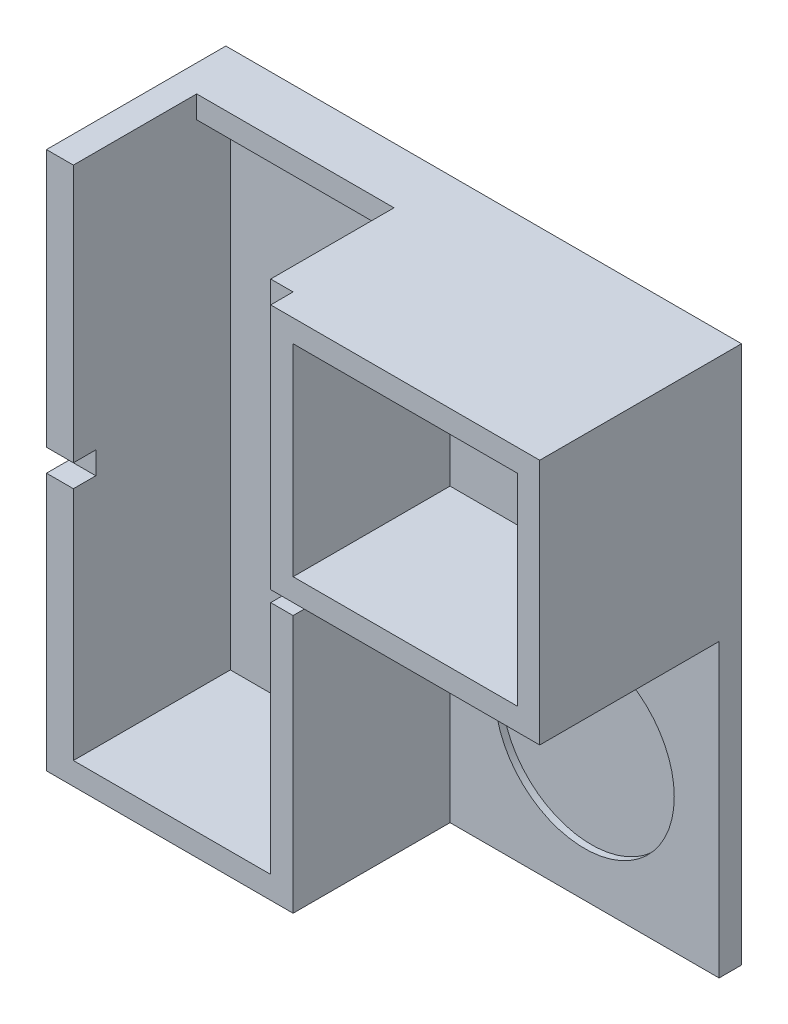
ISO-10303-21;
HEADER;
FILE_DESCRIPTION(('STEP AP214'),'2;1');
FILE_NAME('part.step','',(''),(''),'','','');
FILE_SCHEMA(('AUTOMOTIVE_DESIGN { 1 0 10303 214 1 1 1 1 }'));
ENDSEC;
DATA;
#1=APPLICATION_CONTEXT('core data for automotive mechanical design processes');
#2=APPLICATION_PROTOCOL_DEFINITION('international standard','automotive_design',2000,#1);
#3=PRODUCT_CONTEXT('',#1,'mechanical');
#4=PRODUCT('Part','Part','',(#3));
#5=PRODUCT_RELATED_PRODUCT_CATEGORY('part','',(#4));
#6=PRODUCT_DEFINITION_FORMATION('','',#4);
#7=PRODUCT_DEFINITION_CONTEXT('part definition',#1,'design');
#8=PRODUCT_DEFINITION('design','',#6,#7);
#9=PRODUCT_DEFINITION_SHAPE('','',#8);
#10=(LENGTH_UNIT() NAMED_UNIT(*) SI_UNIT(.MILLI.,.METRE.));
#11=(NAMED_UNIT(*) PLANE_ANGLE_UNIT() SI_UNIT($,.RADIAN.));
#12=(NAMED_UNIT(*) SI_UNIT($,.STERADIAN.) SOLID_ANGLE_UNIT());
#13=UNCERTAINTY_MEASURE_WITH_UNIT(LENGTH_MEASURE(1.E-05),#10,'distance_accuracy_value','');
#14=(GEOMETRIC_REPRESENTATION_CONTEXT(3) GLOBAL_UNCERTAINTY_ASSIGNED_CONTEXT((#13)) GLOBAL_UNIT_ASSIGNED_CONTEXT((#10,
#11,#12)) REPRESENTATION_CONTEXT('',''));
#15=CARTESIAN_POINT('',(0.,0.,0.));
#16=DIRECTION('',(0.,0.,1.));
#17=DIRECTION('',(1.,0.,0.));
#18=AXIS2_PLACEMENT_3D('',#15,#16,#17);
#19=CARTESIAN_POINT('',(-99.2177037871918,25.0239424703892,10.));
#20=DIRECTION('',(0.,-1.,0.));
#21=DIRECTION('',(1.,0.,0.));
#22=AXIS2_PLACEMENT_3D('',#19,#20,#21);
#23=PLANE('',#22);
#24=DIRECTION('',(0.,0.,1.));
#25=VECTOR('',#24,1.);
#26=CARTESIAN_POINT('',(-59.2177037871918,25.0239424703892,25.));
#27=LINE('',#26,#25);
#28=CARTESIAN_POINT('',(-59.2177037871918,25.0239424703892,25.));
#29=VERTEX_POINT('',#28);
#30=CARTESIAN_POINT('',(-59.2177037871918,25.0239424703892,80.));
#31=VERTEX_POINT('',#30);
#32=EDGE_CURVE('E349',#29,#31,#27,.T.);
#33=ORIENTED_EDGE('',*,*,#32,.T.);
#34=DIRECTION('',(-1.,0.,0.));
#35=VECTOR('',#34,1.);
#36=CARTESIAN_POINT('',(-49.2177037871919,25.0239424703891,80.));
#37=LINE('',#36,#35);
#38=CARTESIAN_POINT('',(-49.2177037871919,25.0239424703891,80.));
#39=VERTEX_POINT('',#38);
#40=EDGE_CURVE('E289',#39,#31,#37,.T.);
#41=ORIENTED_EDGE('',*,*,#40,.F.);
#42=DIRECTION('',(0.,0.,-1.));
#43=VECTOR('',#42,1.);
#44=CARTESIAN_POINT('',(-49.2177037871919,25.0239424703892,90.));
#45=LINE('',#44,#43);
#46=CARTESIAN_POINT('',(-49.2177037871919,25.0239424703892,90.));
#47=VERTEX_POINT('',#46);
#48=EDGE_CURVE('E355',#47,#39,#45,.T.);
#49=ORIENTED_EDGE('',*,*,#48,.F.);
#50=DIRECTION('',(1.,0.,0.));
#51=VECTOR('',#50,1.);
#52=CARTESIAN_POINT('',(-49.2177037871919,25.0239424703892,90.));
#53=LINE('',#52,#51);
#54=CARTESIAN_POINT('',(70.7822962128082,25.0239424703892,90.));
#55=VERTEX_POINT('',#54);
#56=EDGE_CURVE('E366',#47,#55,#53,.T.);
#57=ORIENTED_EDGE('',*,*,#56,.T.);
#58=DIRECTION('',(0.,0.,-1.));
#59=VECTOR('',#58,1.);
#60=CARTESIAN_POINT('',(70.7822962128082,25.0239424703892,10.));
#61=LINE('',#60,#59);
#62=CARTESIAN_POINT('',(70.7822962128082,25.0239424703892,0.));
#63=VERTEX_POINT('',#62);
#64=EDGE_CURVE('E92',#55,#63,#61,.T.);
#65=ORIENTED_EDGE('',*,*,#64,.T.);
#66=DIRECTION('',(-1.,0.,0.));
#67=VECTOR('',#66,1.);
#68=CARTESIAN_POINT('',(-99.2177037871918,25.0239424703892,0.));
#69=LINE('',#68,#67);
#70=CARTESIAN_POINT('',(-159.217703787192,25.0239424703892,0.));
#71=VERTEX_POINT('',#70);
#72=EDGE_CURVE('E534',#63,#71,#69,.T.);
#73=ORIENTED_EDGE('',*,*,#72,.T.);
#74=DIRECTION('',(0.,0.,1.));
#75=VECTOR('',#74,1.);
#76=CARTESIAN_POINT('',(-159.217703787192,25.0239424703892,10.));
#77=LINE('',#76,#75);
#78=CARTESIAN_POINT('',(-159.217703787192,25.0239424703891,80.));
#79=VERTEX_POINT('',#78);
#80=EDGE_CURVE('E288',#71,#79,#77,.T.);
#81=ORIENTED_EDGE('',*,*,#80,.T.);
#82=CARTESIAN_POINT('',(-147.217703787192,25.0239424703892,80.));
#83=VERTEX_POINT('',#82);
#84=EDGE_CURVE('E280',#83,#79,#37,.T.);
#85=ORIENTED_EDGE('',*,*,#84,.F.);
#86=DIRECTION('',(0.,0.,-1.));
#87=VECTOR('',#86,1.);
#88=CARTESIAN_POINT('',(-147.217703787192,25.0239424703892,75.));
#89=LINE('',#88,#87);
#90=CARTESIAN_POINT('',(-147.217703787192,25.0239424703892,25.));
#91=VERTEX_POINT('',#90);
#92=EDGE_CURVE('E263',#83,#91,#89,.T.);
#93=ORIENTED_EDGE('',*,*,#92,.T.);
#94=DIRECTION('',(1.,0.,0.));
#95=VECTOR('',#94,1.);
#96=CARTESIAN_POINT('',(-259.217703787192,25.0239424703891,25.));
#97=LINE('',#96,#95);
#98=EDGE_CURVE('E347',#91,#29,#97,.T.);
#99=ORIENTED_EDGE('',*,*,#98,.T.);
#100=EDGE_LOOP('',(#33,#41,#49,#57,#65,#73,#81,#85,#93,#99));
#101=FACE_BOUND('',#100,.T.);
#102=ADVANCED_FACE('F82',(#101),#23,.F.);
#103=CARTESIAN_POINT('',(0.,0.,80.));
#104=DIRECTION('',(0.,0.,1.));
#105=DIRECTION('',(1.,0.,0.));
#106=AXIS2_PLACEMENT_3D('',#103,#104,#105);
#107=PLANE('',#106);
#108=ORIENTED_EDGE('',*,*,#40,.T.);
#109=DIRECTION('',(0.,-1.,0.));
#110=VECTOR('',#109,1.);
#111=CARTESIAN_POINT('',(-59.2177037871919,15.0239424703891,80.));
#112=LINE('',#111,#110);
#113=CARTESIAN_POINT('',(-59.2177037871919,-89.9760575296108,80.));
#114=VERTEX_POINT('',#113);
#115=EDGE_CURVE('E295',#31,#114,#112,.T.);
#116=ORIENTED_EDGE('',*,*,#115,.T.);
#117=DIRECTION('',(-1.,0.,0.));
#118=VECTOR('',#117,1.);
#119=CARTESIAN_POINT('',(-59.2177037871919,-89.9760575296108,80.));
#120=LINE('',#119,#118);
#121=CARTESIAN_POINT('',(-49.2177037871918,-89.9760575296108,80.));
#122=VERTEX_POINT('',#121);
#123=EDGE_CURVE('E431',#122,#114,#120,.T.);
#124=ORIENTED_EDGE('',*,*,#123,.F.);
#125=DIRECTION('',(0.,1.,0.));
#126=VECTOR('',#125,1.);
#127=CARTESIAN_POINT('',(-49.2177037871918,-214.976057529611,80.));
#128=LINE('',#127,#126);
#129=CARTESIAN_POINT('',(-49.2177037871919,-84.9760575296108,80.));
#130=VERTEX_POINT('',#129);
#131=EDGE_CURVE('E333',#122,#130,#128,.T.);
#132=ORIENTED_EDGE('',*,*,#131,.T.);
#133=EDGE_CURVE('E310',#130,#39,#128,.T.);
#134=ORIENTED_EDGE('',*,*,#133,.T.);
#135=EDGE_LOOP('',(#108,#116,#124,#132,#134));
#136=FACE_BOUND('',#135,.T.);
#137=ADVANCED_FACE('F507',(#136),#107,.T.);
#138=DIRECTION('',(1.,0.,0.));
#139=VECTOR('',#138,1.);
#140=CARTESIAN_POINT('',(-147.217703787192,-99.9760575296109,80.));
#141=LINE('',#140,#139);
#142=CARTESIAN_POINT('',(-159.217703787192,-99.9760575296109,80.));
#143=VERTEX_POINT('',#142);
#144=CARTESIAN_POINT('',(-147.217703787192,-99.9760575296109,80.));
#145=VERTEX_POINT('',#144);
#146=EDGE_CURVE('E453',#143,#145,#141,.T.);
#147=ORIENTED_EDGE('',*,*,#146,.F.);
#148=DIRECTION('',(0.,-1.,0.));
#149=VECTOR('',#148,1.);
#150=CARTESIAN_POINT('',(-159.217703787192,35.0239424703892,80.));
#151=LINE('',#150,#149);
#152=CARTESIAN_POINT('',(-159.217703787192,-214.976057529611,80.));
#153=VERTEX_POINT('',#152);
#154=EDGE_CURVE('E377',#143,#153,#151,.T.);
#155=ORIENTED_EDGE('',*,*,#154,.T.);
#156=DIRECTION('',(-1.,0.,0.));
#157=VECTOR('',#156,1.);
#158=CARTESIAN_POINT('',(-49.2177037871918,-214.976057529611,80.));
#159=LINE('',#158,#157);
#160=CARTESIAN_POINT('',(-49.2177037871918,-214.976057529611,80.));
#161=VERTEX_POINT('',#160);
#162=EDGE_CURVE('E317',#161,#153,#159,.T.);
#163=ORIENTED_EDGE('',*,*,#162,.F.);
#164=CARTESIAN_POINT('',(-49.2177037871918,-99.9760575296108,80.));
#165=VERTEX_POINT('',#164);
#166=EDGE_CURVE('E330',#161,#165,#128,.T.);
#167=ORIENTED_EDGE('',*,*,#166,.T.);
#168=DIRECTION('',(1.,0.,0.));
#169=VECTOR('',#168,1.);
#170=CARTESIAN_POINT('',(-59.2177037871919,-99.9760575296108,80.));
#171=LINE('',#170,#169);
#172=CARTESIAN_POINT('',(-59.2177037871919,-99.9760575296108,80.));
#173=VERTEX_POINT('',#172);
#174=EDGE_CURVE('E434',#173,#165,#171,.T.);
#175=ORIENTED_EDGE('',*,*,#174,.F.);
#176=CARTESIAN_POINT('',(-59.2177037871918,-204.976057529611,80.));
#177=VERTEX_POINT('',#176);
#178=EDGE_CURVE('E86',#173,#177,#112,.T.);
#179=ORIENTED_EDGE('',*,*,#178,.T.);
#180=DIRECTION('',(-1.,0.,0.));
#181=VECTOR('',#180,1.);
#182=CARTESIAN_POINT('',(-49.2177037871918,-204.976057529611,80.));
#183=LINE('',#182,#181);
#184=CARTESIAN_POINT('',(-147.217703787192,-204.976057529611,80.));
#185=VERTEX_POINT('',#184);
#186=EDGE_CURVE('E327',#177,#185,#183,.T.);
#187=ORIENTED_EDGE('',*,*,#186,.T.);
#188=DIRECTION('',(0.,1.,0.));
#189=VECTOR('',#188,1.);
#190=CARTESIAN_POINT('',(-147.217703787192,-204.976057529611,80.));
#191=LINE('',#190,#189);
#192=EDGE_CURVE('E283',#185,#145,#191,.T.);
#193=ORIENTED_EDGE('',*,*,#192,.T.);
#194=EDGE_LOOP('',(#147,#155,#163,#167,#175,#179,#187,#193));
#195=FACE_BOUND('',#194,.T.);
#196=ADVANCED_FACE('F475',(#195),#107,.T.);
#197=CARTESIAN_POINT('',(-49.2177037871919,15.0239424703891,80.));
#198=DIRECTION('',(0.,-1.,0.));
#199=DIRECTION('',(1.,0.,0.));
#200=AXIS2_PLACEMENT_3D('',#197,#198,#199);
#201=PLANE('',#200);
#202=DIRECTION('',(-1.,0.,0.));
#203=VECTOR('',#202,1.);
#204=CARTESIAN_POINT('',(-49.2177037871919,15.0239424703891,25.));
#205=LINE('',#204,#203);
#206=CARTESIAN_POINT('',(-59.2177037871918,15.0239424703891,25.));
#207=VERTEX_POINT('',#206);
#208=CARTESIAN_POINT('',(-147.217703787192,15.0239424703891,25.));
#209=VERTEX_POINT('',#208);
#210=EDGE_CURVE('E338',#207,#209,#205,.T.);
#211=ORIENTED_EDGE('',*,*,#210,.T.);
#212=DIRECTION('',(0.,0.,1.));
#213=VECTOR('',#212,1.);
#214=CARTESIAN_POINT('',(-147.217703787192,15.0239424703891,80.));
#215=LINE('',#214,#213);
#216=CARTESIAN_POINT('',(-147.217703787192,15.0239424703891,10.));
#217=VERTEX_POINT('',#216);
#218=EDGE_CURVE('E417',#217,#209,#215,.T.);
#219=ORIENTED_EDGE('',*,*,#218,.F.);
#220=DIRECTION('',(-1.,0.,0.));
#221=VECTOR('',#220,1.);
#222=CARTESIAN_POINT('',(-49.2177037871919,15.0239424703891,10.));
#223=LINE('',#222,#221);
#224=CARTESIAN_POINT('',(-59.2177037871919,15.0239424703891,10.));
#225=VERTEX_POINT('',#224);
#226=EDGE_CURVE('E290',#225,#217,#223,.T.);
#227=ORIENTED_EDGE('',*,*,#226,.F.);
#228=DIRECTION('',(0.,0.,-1.));
#229=VECTOR('',#228,1.);
#230=CARTESIAN_POINT('',(-59.2177037871919,15.0239424703891,80.));
#231=LINE('',#230,#229);
#232=EDGE_CURVE('E293',#207,#225,#231,.T.);
#233=ORIENTED_EDGE('',*,*,#232,.F.);
#234=EDGE_LOOP('',(#211,#219,#227,#233));
#235=FACE_BOUND('',#234,.T.);
#236=ADVANCED_FACE('F492',(#235),#201,.T.);
#237=CARTESIAN_POINT('',(0.,0.,10.));
#238=DIRECTION('',(0.,0.,1.));
#239=DIRECTION('',(1.,0.,0.));
#240=AXIS2_PLACEMENT_3D('',#237,#238,#239);
#241=PLANE('',#240);
#242=ORIENTED_EDGE('',*,*,#226,.T.);
#243=DIRECTION('',(0.,1.,0.));
#244=VECTOR('',#243,1.);
#245=CARTESIAN_POINT('',(-147.217703787192,-204.976057529611,10.));
#246=LINE('',#245,#244);
#247=CARTESIAN_POINT('',(-147.217703787192,-204.976057529611,10.));
#248=VERTEX_POINT('',#247);
#249=EDGE_CURVE('E284',#248,#217,#246,.T.);
#250=ORIENTED_EDGE('',*,*,#249,.F.);
#251=DIRECTION('',(-1.,0.,0.));
#252=VECTOR('',#251,1.);
#253=CARTESIAN_POINT('',(-49.2177037871918,-204.976057529611,10.));
#254=LINE('',#253,#252);
#255=CARTESIAN_POINT('',(-59.2177037871918,-204.976057529611,10.));
#256=VERTEX_POINT('',#255);
#257=EDGE_CURVE('E307',#256,#248,#254,.T.);
#258=ORIENTED_EDGE('',*,*,#257,.F.);
#259=DIRECTION('',(0.,-1.,0.));
#260=VECTOR('',#259,1.);
#261=CARTESIAN_POINT('',(-59.2177037871919,15.0239424703891,10.));
#262=LINE('',#261,#260);
#263=EDGE_CURVE('E341',#225,#256,#262,.T.);
#264=ORIENTED_EDGE('',*,*,#263,.F.);
#265=EDGE_LOOP('',(#242,#250,#258,#264));
#266=FACE_BOUND('',#265,.T.);
#267=ADVANCED_FACE('F487',(#266),#241,.T.);
#268=CARTESIAN_POINT('',(-49.2177037871918,-204.976057529611,80.));
#269=DIRECTION('',(0.,-1.,0.));
#270=DIRECTION('',(1.,0.,0.));
#271=AXIS2_PLACEMENT_3D('',#268,#269,#270);
#272=PLANE('',#271);
#273=DIRECTION('',(0.,0.,1.));
#274=VECTOR('',#273,1.);
#275=CARTESIAN_POINT('',(-147.217703787192,-204.976057529611,80.));
#276=LINE('',#275,#274);
#277=EDGE_CURVE('E416',#248,#185,#276,.T.);
#278=ORIENTED_EDGE('',*,*,#277,.T.);
#279=ORIENTED_EDGE('',*,*,#186,.F.);
#280=DIRECTION('',(0.,0.,1.));
#281=VECTOR('',#280,1.);
#282=CARTESIAN_POINT('',(-59.2177037871918,-204.976057529611,80.));
#283=LINE('',#282,#281);
#284=EDGE_CURVE('E316',#256,#177,#283,.T.);
#285=ORIENTED_EDGE('',*,*,#284,.F.);
#286=ORIENTED_EDGE('',*,*,#257,.T.);
#287=EDGE_LOOP('',(#278,#279,#285,#286));
#288=FACE_BOUND('',#287,.T.);
#289=ADVANCED_FACE('F482',(#288),#272,.F.);
#290=CARTESIAN_POINT('',(-259.217703787192,-74.9760575296109,25.));
#291=DIRECTION('',(0.,0.,1.));
#292=DIRECTION('',(1.,0.,0.));
#293=AXIS2_PLACEMENT_3D('',#290,#291,#292);
#294=PLANE('',#293);
#295=ORIENTED_EDGE('',*,*,#98,.F.);
#296=DIRECTION('',(0.,1.,0.));
#297=VECTOR('',#296,1.);
#298=CARTESIAN_POINT('',(-147.217703787192,25.0239424703892,25.));
#299=LINE('',#298,#297);
#300=EDGE_CURVE('E270',#209,#91,#299,.T.);
#301=ORIENTED_EDGE('',*,*,#300,.F.);
#302=ORIENTED_EDGE('',*,*,#210,.F.);
#303=DIRECTION('',(0.,1.,0.));
#304=VECTOR('',#303,1.);
#305=CARTESIAN_POINT('',(-59.2177037871918,-74.9760575296108,25.));
#306=LINE('',#305,#304);
#307=EDGE_CURVE('E344',#207,#29,#306,.T.);
#308=ORIENTED_EDGE('',*,*,#307,.T.);
#309=EDGE_LOOP('',(#295,#301,#302,#308));
#310=FACE_BOUND('',#309,.T.);
#311=ADVANCED_FACE('F494',(#310),#294,.T.);
#312=CARTESIAN_POINT('',(-99.2177037871918,-214.976057529611,10.));
#313=DIRECTION('',(0.,-1.,0.));
#314=DIRECTION('',(1.,0.,0.));
#315=AXIS2_PLACEMENT_3D('',#312,#313,#314);
#316=PLANE('',#315);
#317=DIRECTION('',(0.,0.,1.));
#318=VECTOR('',#317,1.);
#319=CARTESIAN_POINT('',(-159.217703787192,-214.976057529611,80.));
#320=LINE('',#319,#318);
#321=CARTESIAN_POINT('',(-159.217703787192,-214.976057529611,0.));
#322=VERTEX_POINT('',#321);
#323=EDGE_CURVE('E274',#322,#153,#320,.T.);
#324=ORIENTED_EDGE('',*,*,#323,.F.);
#325=DIRECTION('',(-1.,0.,0.));
#326=VECTOR('',#325,1.);
#327=CARTESIAN_POINT('',(-99.2177037871918,-214.976057529611,0.));
#328=LINE('',#327,#326);
#329=CARTESIAN_POINT('',(70.7822962128082,-214.976057529611,0.));
#330=VERTEX_POINT('',#329);
#331=EDGE_CURVE('E536',#330,#322,#328,.T.);
#332=ORIENTED_EDGE('',*,*,#331,.F.);
#333=DIRECTION('',(0.,0.,-1.));
#334=VECTOR('',#333,1.);
#335=CARTESIAN_POINT('',(70.7822962128082,-214.976057529611,10.));
#336=LINE('',#335,#334);
#337=CARTESIAN_POINT('',(70.7822962128082,-214.976057529611,10.));
#338=VERTEX_POINT('',#337);
#339=EDGE_CURVE('E12',#338,#330,#336,.T.);
#340=ORIENTED_EDGE('',*,*,#339,.F.);
#341=DIRECTION('',(1.,0.,0.));
#342=VECTOR('',#341,1.);
#343=CARTESIAN_POINT('',(-99.2177037871918,-214.976057529611,10.));
#344=LINE('',#343,#342);
#345=CARTESIAN_POINT('',(-49.2177037871919,-214.976057529611,10.));
#346=VERTEX_POINT('',#345);
#347=EDGE_CURVE('E320',#346,#338,#344,.T.);
#348=ORIENTED_EDGE('',*,*,#347,.F.);
#349=DIRECTION('',(0.,0.,-1.));
#350=VECTOR('',#349,1.);
#351=CARTESIAN_POINT('',(-49.2177037871918,-214.976057529611,80.));
#352=LINE('',#351,#350);
#353=EDGE_CURVE('E313',#161,#346,#352,.T.);
#354=ORIENTED_EDGE('',*,*,#353,.F.);
#355=ORIENTED_EDGE('',*,*,#162,.T.);
#356=EDGE_LOOP('',(#324,#332,#340,#348,#354,#355));
#357=FACE_BOUND('',#356,.T.);
#358=ADVANCED_FACE('F531',(#357),#316,.T.);
#359=CARTESIAN_POINT('',(70.7822962128082,0.,10.));
#360=DIRECTION('',(1.,0.,0.));
#361=DIRECTION('',(0.,1.,0.));
#362=AXIS2_PLACEMENT_3D('',#359,#360,#361);
#363=PLANE('',#362);
#364=DIRECTION('',(0.,-1.,0.));
#365=VECTOR('',#364,1.);
#366=CARTESIAN_POINT('',(70.7822962128082,0.,0.));
#367=LINE('',#366,#365);
#368=EDGE_CURVE('E542',#63,#330,#367,.T.);
#369=ORIENTED_EDGE('',*,*,#368,.F.);
#370=ORIENTED_EDGE('',*,*,#64,.F.);
#371=DIRECTION('',(0.,1.,0.));
#372=VECTOR('',#371,1.);
#373=CARTESIAN_POINT('',(70.7822962128082,-84.9760575296108,90.));
#374=LINE('',#373,#372);
#375=CARTESIAN_POINT('',(70.7822962128082,-84.9760575296108,90.));
#376=VERTEX_POINT('',#375);
#377=EDGE_CURVE('E363',#376,#55,#374,.T.);
#378=ORIENTED_EDGE('',*,*,#377,.F.);
#379=DIRECTION('',(0.,0.,-1.));
#380=VECTOR('',#379,1.);
#381=CARTESIAN_POINT('',(70.7822962128082,-84.9760575296108,90.));
#382=LINE('',#381,#380);
#383=CARTESIAN_POINT('',(70.7822962128082,-84.9760575296108,10.));
#384=VERTEX_POINT('',#383);
#385=EDGE_CURVE('E351',#376,#384,#382,.T.);
#386=ORIENTED_EDGE('',*,*,#385,.T.);
#387=DIRECTION('',(0.,1.,0.));
#388=VECTOR('',#387,1.);
#389=CARTESIAN_POINT('',(70.7822962128082,0.,10.));
#390=LINE('',#389,#388);
#391=EDGE_CURVE('E532',#338,#384,#390,.T.);
#392=ORIENTED_EDGE('',*,*,#391,.F.);
#393=ORIENTED_EDGE('',*,*,#339,.T.);
#394=EDGE_LOOP('',(#369,#370,#378,#386,#392,#393));
#395=FACE_BOUND('',#394,.T.);
#396=ADVANCED_FACE('F84',(#395),#363,.T.);
#397=DIRECTION('',(-1.,0.,0.));
#398=VECTOR('',#397,1.);
#399=CARTESIAN_POINT('',(70.7822962128082,-84.9760575296108,10.));
#400=LINE('',#399,#398);
#401=CARTESIAN_POINT('',(-49.2177037871919,-84.9760575296108,10.));
#402=VERTEX_POINT('',#401);
#403=EDGE_CURVE('E359',#384,#402,#400,.T.);
#404=ORIENTED_EDGE('',*,*,#403,.T.);
#405=DIRECTION('',(0.,1.,0.));
#406=VECTOR('',#405,1.);
#407=CARTESIAN_POINT('',(-49.2177037871918,-214.976057529611,10.));
#408=LINE('',#407,#406);
#409=EDGE_CURVE('E306',#346,#402,#408,.T.);
#410=ORIENTED_EDGE('',*,*,#409,.F.);
#411=ORIENTED_EDGE('',*,*,#347,.T.);
#412=ORIENTED_EDGE('',*,*,#391,.T.);
#413=EDGE_LOOP('',(#404,#410,#411,#412));
#414=FACE_BOUND('',#413,.T.);
#415=CARTESIAN_POINT('',(10.7822962128082,-154.976057529611,10.));
#416=DIRECTION('',(0.,0.,1.));
#417=DIRECTION('',(1.,0.,0.));
#418=AXIS2_PLACEMENT_3D('',#415,#416,#417);
#419=CIRCLE('',#418,40.);
#420=CARTESIAN_POINT('',(50.7822962128082,-154.976057529611,10.));
#421=VERTEX_POINT('',#420);
#422=EDGE_CURVE('E334',#421,#421,#419,.T.);
#423=ORIENTED_EDGE('',*,*,#422,.F.);
#424=EDGE_LOOP('',(#423));
#425=FACE_BOUND('',#424,.T.);
#426=ADVANCED_FACE('F524',(#414,#425),#241,.T.);
#427=CARTESIAN_POINT('',(0.,0.,0.));
#428=DIRECTION('',(0.,0.,1.));
#429=DIRECTION('',(1.,0.,0.));
#430=AXIS2_PLACEMENT_3D('',#427,#428,#429);
#431=PLANE('',#430);
#432=ORIENTED_EDGE('',*,*,#331,.T.);
#433=DIRECTION('',(0.,-1.,0.));
#434=VECTOR('',#433,1.);
#435=CARTESIAN_POINT('',(-159.217703787192,35.0239424703892,0.));
#436=LINE('',#435,#434);
#437=EDGE_CURVE('E375',#71,#322,#436,.T.);
#438=ORIENTED_EDGE('',*,*,#437,.F.);
#439=ORIENTED_EDGE('',*,*,#72,.F.);
#440=ORIENTED_EDGE('',*,*,#368,.T.);
#441=EDGE_LOOP('',(#432,#438,#439,#440));
#442=FACE_BOUND('',#441,.T.);
#443=ADVANCED_FACE('F548',(#442),#431,.F.);
#444=CARTESIAN_POINT('',(-49.2177037871918,-214.976057529611,80.));
#445=DIRECTION('',(-1.,0.,0.));
#446=DIRECTION('',(0.,-1.,0.));
#447=AXIS2_PLACEMENT_3D('',#444,#445,#446);
#448=PLANE('',#447);
#449=ORIENTED_EDGE('',*,*,#131,.F.);
#450=DIRECTION('',(0.,0.,1.));
#451=VECTOR('',#450,1.);
#452=CARTESIAN_POINT('',(-49.2177037871918,-89.9760575296108,70.));
#453=LINE('',#452,#451);
#454=CARTESIAN_POINT('',(-49.2177037871918,-89.9760575296108,70.));
#455=VERTEX_POINT('',#454);
#456=EDGE_CURVE('E427',#455,#122,#453,.T.);
#457=ORIENTED_EDGE('',*,*,#456,.F.);
#458=DIRECTION('',(0.,1.,0.));
#459=VECTOR('',#458,1.);
#460=CARTESIAN_POINT('',(-49.2177037871918,-99.9760575296108,70.));
#461=LINE('',#460,#459);
#462=CARTESIAN_POINT('',(-49.2177037871918,-99.9760575296108,70.));
#463=VERTEX_POINT('',#462);
#464=EDGE_CURVE('E438',#463,#455,#461,.T.);
#465=ORIENTED_EDGE('',*,*,#464,.F.);
#466=DIRECTION('',(0.,0.,1.));
#467=VECTOR('',#466,1.);
#468=CARTESIAN_POINT('',(-49.2177037871918,-99.9760575296108,70.));
#469=LINE('',#468,#467);
#470=EDGE_CURVE('E424',#463,#165,#469,.T.);
#471=ORIENTED_EDGE('',*,*,#470,.T.);
#472=ORIENTED_EDGE('',*,*,#166,.F.);
#473=ORIENTED_EDGE('',*,*,#353,.T.);
#474=ORIENTED_EDGE('',*,*,#409,.T.);
#475=DIRECTION('',(0.,0.,-1.));
#476=VECTOR('',#475,1.);
#477=CARTESIAN_POINT('',(-49.2177037871919,-84.9760575296108,90.));
#478=LINE('',#477,#476);
#479=EDGE_CURVE('E356',#130,#402,#478,.T.);
#480=ORIENTED_EDGE('',*,*,#479,.F.);
#481=EDGE_LOOP('',(#449,#457,#465,#471,#472,#473,#474,#480));
#482=FACE_BOUND('',#481,.T.);
#483=ADVANCED_FACE('F519',(#482),#448,.F.);
#484=CARTESIAN_POINT('',(-147.217703787192,-89.9760575296108,80.));
#485=VERTEX_POINT('',#484);
#486=EDGE_CURVE('E268',#485,#83,#191,.T.);
#487=ORIENTED_EDGE('',*,*,#486,.T.);
#488=ORIENTED_EDGE('',*,*,#84,.T.);
#489=CARTESIAN_POINT('',(-159.217703787192,-89.9760575296108,80.));
#490=VERTEX_POINT('',#489);
#491=EDGE_CURVE('E374',#79,#490,#151,.T.);
#492=ORIENTED_EDGE('',*,*,#491,.T.);
#493=DIRECTION('',(-1.,0.,0.));
#494=VECTOR('',#493,1.);
#495=CARTESIAN_POINT('',(-147.217703787192,-89.9760575296108,80.));
#496=LINE('',#495,#494);
#497=EDGE_CURVE('E282',#485,#490,#496,.T.);
#498=ORIENTED_EDGE('',*,*,#497,.F.);
#499=EDGE_LOOP('',(#487,#488,#492,#498));
#500=FACE_BOUND('',#499,.T.);
#501=ADVANCED_FACE('F278',(#500),#107,.T.);
#502=CARTESIAN_POINT('',(-59.2177037871919,15.0239424703891,80.));
#503=DIRECTION('',(1.,0.,0.));
#504=DIRECTION('',(0.,1.,0.));
#505=AXIS2_PLACEMENT_3D('',#502,#503,#504);
#506=PLANE('',#505);
#507=ORIENTED_EDGE('',*,*,#115,.F.);
#508=ORIENTED_EDGE('',*,*,#32,.F.);
#509=ORIENTED_EDGE('',*,*,#307,.F.);
#510=ORIENTED_EDGE('',*,*,#232,.T.);
#511=ORIENTED_EDGE('',*,*,#263,.T.);
#512=ORIENTED_EDGE('',*,*,#284,.T.);
#513=ORIENTED_EDGE('',*,*,#178,.F.);
#514=DIRECTION('',(0.,0.,1.));
#515=VECTOR('',#514,1.);
#516=CARTESIAN_POINT('',(-59.2177037871919,-99.9760575296108,70.));
#517=LINE('',#516,#515);
#518=CARTESIAN_POINT('',(-59.2177037871919,-99.9760575296108,70.));
#519=VERTEX_POINT('',#518);
#520=EDGE_CURVE('E422',#519,#173,#517,.T.);
#521=ORIENTED_EDGE('',*,*,#520,.F.);
#522=DIRECTION('',(0.,-1.,0.));
#523=VECTOR('',#522,1.);
#524=CARTESIAN_POINT('',(-59.2177037871919,-99.9760575296108,70.));
#525=LINE('',#524,#523);
#526=CARTESIAN_POINT('',(-59.2177037871919,-89.9760575296108,70.));
#527=VERTEX_POINT('',#526);
#528=EDGE_CURVE('E433',#527,#519,#525,.T.);
#529=ORIENTED_EDGE('',*,*,#528,.F.);
#530=DIRECTION('',(0.,0.,1.));
#531=VECTOR('',#530,1.);
#532=CARTESIAN_POINT('',(-59.2177037871919,-89.9760575296108,70.));
#533=LINE('',#532,#531);
#534=EDGE_CURVE('E419',#527,#114,#533,.T.);
#535=ORIENTED_EDGE('',*,*,#534,.T.);
#536=EDGE_LOOP('',(#507,#508,#509,#510,#511,#512,#513,#521,#529,#535));
#537=FACE_BOUND('',#536,.T.);
#538=ADVANCED_FACE('F502',(#537),#506,.F.);
#539=CARTESIAN_POINT('',(10.7822962128082,-154.976057529611,7.));
#540=DIRECTION('',(0.,0.,1.));
#541=DIRECTION('',(1.,0.,0.));
#542=AXIS2_PLACEMENT_3D('',#539,#540,#541);
#543=CYLINDRICAL_SURFACE('',#542,40.);
#544=CARTESIAN_POINT('',(10.7822962128082,-154.976057529611,7.));
#545=DIRECTION('',(0.,0.,1.));
#546=DIRECTION('',(1.,0.,0.));
#547=AXIS2_PLACEMENT_3D('',#544,#545,#546);
#548=CIRCLE('',#547,40.);
#549=CARTESIAN_POINT('',(50.7822962128082,-154.976057529611,7.));
#550=VERTEX_POINT('',#549);
#551=EDGE_CURVE('E337',#550,#550,#548,.T.);
#552=ORIENTED_EDGE('',*,*,#551,.F.);
#553=EDGE_LOOP('',(#552));
#554=FACE_BOUND('',#553,.T.);
#555=ORIENTED_EDGE('',*,*,#422,.T.);
#556=EDGE_LOOP('',(#555));
#557=FACE_BOUND('',#556,.T.);
#558=ADVANCED_FACE('F588',(#554,#557),#543,.F.);
#559=CARTESIAN_POINT('',(10.7822962128082,-154.976057529611,7.));
#560=DIRECTION('',(0.,0.,1.));
#561=DIRECTION('',(1.,0.,0.));
#562=AXIS2_PLACEMENT_3D('',#559,#560,#561);
#563=PLANE('',#562);
#564=ORIENTED_EDGE('',*,*,#551,.T.);
#565=EDGE_LOOP('',(#564));
#566=FACE_BOUND('',#565,.T.);
#567=ADVANCED_FACE('F585',(#566),#563,.T.);
#568=CARTESIAN_POINT('',(70.7822962128082,-84.9760575296108,90.));
#569=DIRECTION('',(0.,-1.,0.));
#570=DIRECTION('',(1.,0.,0.));
#571=AXIS2_PLACEMENT_3D('',#568,#569,#570);
#572=PLANE('',#571);
#573=ORIENTED_EDGE('',*,*,#403,.F.);
#574=ORIENTED_EDGE('',*,*,#385,.F.);
#575=DIRECTION('',(-1.,0.,0.));
#576=VECTOR('',#575,1.);
#577=CARTESIAN_POINT('',(70.7822962128082,-84.9760575296108,90.));
#578=LINE('',#577,#576);
#579=CARTESIAN_POINT('',(-49.2177037871919,-84.9760575296108,90.));
#580=VERTEX_POINT('',#579);
#581=EDGE_CURVE('E362',#376,#580,#578,.T.);
#582=ORIENTED_EDGE('',*,*,#581,.T.);
#583=EDGE_CURVE('E352',#580,#130,#478,.T.);
#584=ORIENTED_EDGE('',*,*,#583,.T.);
#585=ORIENTED_EDGE('',*,*,#479,.T.);
#586=EDGE_LOOP('',(#573,#574,#582,#584,#585));
#587=FACE_BOUND('',#586,.T.);
#588=ADVANCED_FACE('F516',(#587),#572,.T.);
#589=CARTESIAN_POINT('',(-49.2177037871919,-74.9760575296108,90.));
#590=DIRECTION('',(-1.,0.,0.));
#591=DIRECTION('',(0.,0.,1.));
#592=AXIS2_PLACEMENT_3D('',#589,#590,#591);
#593=PLANE('',#592);
#594=ORIENTED_EDGE('',*,*,#48,.T.);
#595=ORIENTED_EDGE('',*,*,#133,.F.);
#596=ORIENTED_EDGE('',*,*,#583,.F.);
#597=DIRECTION('',(0.,-1.,0.));
#598=VECTOR('',#597,1.);
#599=CARTESIAN_POINT('',(-49.2177037871919,-74.9760575296108,90.));
#600=LINE('',#599,#598);
#601=EDGE_CURVE('E369',#47,#580,#600,.T.);
#602=ORIENTED_EDGE('',*,*,#601,.F.);
#603=EDGE_LOOP('',(#594,#595,#596,#602));
#604=FACE_BOUND('',#603,.T.);
#605=ADVANCED_FACE('F512',(#604),#593,.T.);
#606=CARTESIAN_POINT('',(0.,0.,90.));
#607=DIRECTION('',(0.,0.,1.));
#608=DIRECTION('',(1.,0.,0.));
#609=AXIS2_PLACEMENT_3D('',#606,#607,#608);
#610=PLANE('',#609);
#611=DIRECTION('',(0.,1.,0.));
#612=VECTOR('',#611,1.);
#613=CARTESIAN_POINT('',(60.7822962128082,15.0239424703892,90.));
#614=LINE('',#613,#612);
#615=CARTESIAN_POINT('',(60.7822962128082,-74.9760575296108,90.));
#616=VERTEX_POINT('',#615);
#617=CARTESIAN_POINT('',(60.7822962128082,15.0239424703892,90.));
#618=VERTEX_POINT('',#617);
#619=EDGE_CURVE('E402',#616,#618,#614,.T.);
#620=ORIENTED_EDGE('',*,*,#619,.F.);
#621=DIRECTION('',(1.,0.,0.));
#622=VECTOR('',#621,1.);
#623=CARTESIAN_POINT('',(60.7822962128082,-74.9760575296108,90.));
#624=LINE('',#623,#622);
#625=CARTESIAN_POINT('',(-39.2177037871918,-74.9760575296108,90.));
#626=VERTEX_POINT('',#625);
#627=EDGE_CURVE('E392',#626,#616,#624,.T.);
#628=ORIENTED_EDGE('',*,*,#627,.F.);
#629=DIRECTION('',(0.,-1.,0.));
#630=VECTOR('',#629,1.);
#631=CARTESIAN_POINT('',(-39.2177037871919,15.0239424703891,90.));
#632=LINE('',#631,#630);
#633=CARTESIAN_POINT('',(-39.2177037871919,15.0239424703891,90.));
#634=VERTEX_POINT('',#633);
#635=EDGE_CURVE('E396',#634,#626,#632,.T.);
#636=ORIENTED_EDGE('',*,*,#635,.F.);
#637=DIRECTION('',(-1.,0.,0.));
#638=VECTOR('',#637,1.);
#639=CARTESIAN_POINT('',(60.7822962128082,15.0239424703892,90.));
#640=LINE('',#639,#638);
#641=EDGE_CURVE('E399',#618,#634,#640,.T.);
#642=ORIENTED_EDGE('',*,*,#641,.F.);
#643=EDGE_LOOP('',(#620,#628,#636,#642));
#644=FACE_BOUND('',#643,.T.);
#645=ORIENTED_EDGE('',*,*,#581,.F.);
#646=ORIENTED_EDGE('',*,*,#377,.T.);
#647=ORIENTED_EDGE('',*,*,#56,.F.);
#648=ORIENTED_EDGE('',*,*,#601,.T.);
#649=EDGE_LOOP('',(#645,#646,#647,#648));
#650=FACE_BOUND('',#649,.T.);
#651=ADVANCED_FACE('F554',(#644,#650),#610,.T.);
#652=CARTESIAN_POINT('',(-159.217703787192,35.0239424703892,80.));
#653=DIRECTION('',(1.,0.,0.));
#654=DIRECTION('',(0.,1.,0.));
#655=AXIS2_PLACEMENT_3D('',#652,#653,#654);
#656=PLANE('',#655);
#657=ORIENTED_EDGE('',*,*,#154,.F.);
#658=DIRECTION('',(0.,0.,1.));
#659=VECTOR('',#658,1.);
#660=CARTESIAN_POINT('',(-159.217703787192,-99.9760575296109,70.));
#661=LINE('',#660,#659);
#662=CARTESIAN_POINT('',(-159.217703787192,-99.9760575296109,70.));
#663=VERTEX_POINT('',#662);
#664=EDGE_CURVE('E449',#663,#143,#661,.T.);
#665=ORIENTED_EDGE('',*,*,#664,.F.);
#666=DIRECTION('',(0.,-1.,0.));
#667=VECTOR('',#666,1.);
#668=CARTESIAN_POINT('',(-159.217703787192,-89.9760575296108,70.));
#669=LINE('',#668,#667);
#670=CARTESIAN_POINT('',(-159.217703787192,-89.9760575296108,70.));
#671=VERTEX_POINT('',#670);
#672=EDGE_CURVE('E458',#671,#663,#669,.T.);
#673=ORIENTED_EDGE('',*,*,#672,.F.);
#674=DIRECTION('',(0.,0.,1.));
#675=VECTOR('',#674,1.);
#676=CARTESIAN_POINT('',(-159.217703787192,-89.9760575296108,70.));
#677=LINE('',#676,#675);
#678=EDGE_CURVE('E446',#671,#490,#677,.T.);
#679=ORIENTED_EDGE('',*,*,#678,.T.);
#680=ORIENTED_EDGE('',*,*,#491,.F.);
#681=ORIENTED_EDGE('',*,*,#80,.F.);
#682=ORIENTED_EDGE('',*,*,#437,.T.);
#683=ORIENTED_EDGE('',*,*,#323,.T.);
#684=EDGE_LOOP('',(#657,#665,#673,#679,#680,#681,#682,#683));
#685=FACE_BOUND('',#684,.T.);
#686=ADVANCED_FACE('F469',(#685),#656,.F.);
#687=CARTESIAN_POINT('',(-147.217703787192,25.0239424703892,75.));
#688=DIRECTION('',(-1.,0.,0.));
#689=DIRECTION('',(0.,0.,1.));
#690=AXIS2_PLACEMENT_3D('',#687,#688,#689);
#691=PLANE('',#690);
#692=DIRECTION('',(0.,1.,0.));
#693=VECTOR('',#692,1.);
#694=CARTESIAN_POINT('',(-147.217703787192,-89.9760575296108,70.));
#695=LINE('',#694,#693);
#696=CARTESIAN_POINT('',(-147.217703787192,-99.9760575296109,70.));
#697=VERTEX_POINT('',#696);
#698=CARTESIAN_POINT('',(-147.217703787192,-89.9760575296108,70.));
#699=VERTEX_POINT('',#698);
#700=EDGE_CURVE('E455',#697,#699,#695,.T.);
#701=ORIENTED_EDGE('',*,*,#700,.F.);
#702=DIRECTION('',(0.,0.,1.));
#703=VECTOR('',#702,1.);
#704=CARTESIAN_POINT('',(-147.217703787192,-99.9760575296109,70.));
#705=LINE('',#704,#703);
#706=EDGE_CURVE('E436',#697,#145,#705,.T.);
#707=ORIENTED_EDGE('',*,*,#706,.T.);
#708=ORIENTED_EDGE('',*,*,#192,.F.);
#709=ORIENTED_EDGE('',*,*,#277,.F.);
#710=ORIENTED_EDGE('',*,*,#249,.T.);
#711=ORIENTED_EDGE('',*,*,#218,.T.);
#712=ORIENTED_EDGE('',*,*,#300,.T.);
#713=ORIENTED_EDGE('',*,*,#92,.F.);
#714=ORIENTED_EDGE('',*,*,#486,.F.);
#715=DIRECTION('',(0.,0.,1.));
#716=VECTOR('',#715,1.);
#717=CARTESIAN_POINT('',(-147.217703787192,-89.9760575296108,70.));
#718=LINE('',#717,#716);
#719=EDGE_CURVE('E444',#699,#485,#718,.T.);
#720=ORIENTED_EDGE('',*,*,#719,.F.);
#721=EDGE_LOOP('',(#701,#707,#708,#709,#710,#711,#712,#713,#714,#720));
#722=FACE_BOUND('',#721,.T.);
#723=ADVANCED_FACE('F266',(#722),#691,.F.);
#724=CARTESIAN_POINT('',(60.7822962128082,15.0239424703892,20.));
#725=DIRECTION('',(1.,0.,0.));
#726=DIRECTION('',(0.,1.,0.));
#727=AXIS2_PLACEMENT_3D('',#724,#725,#726);
#728=PLANE('',#727);
#729=ORIENTED_EDGE('',*,*,#619,.T.);
#730=DIRECTION('',(0.,0.,1.));
#731=VECTOR('',#730,1.);
#732=CARTESIAN_POINT('',(60.7822962128082,15.0239424703892,20.));
#733=LINE('',#732,#731);
#734=CARTESIAN_POINT('',(60.7822962128082,15.0239424703892,20.));
#735=VERTEX_POINT('',#734);
#736=EDGE_CURVE('E383',#735,#618,#733,.T.);
#737=ORIENTED_EDGE('',*,*,#736,.F.);
#738=DIRECTION('',(0.,1.,0.));
#739=VECTOR('',#738,1.);
#740=CARTESIAN_POINT('',(60.7822962128082,15.0239424703892,20.));
#741=LINE('',#740,#739);
#742=CARTESIAN_POINT('',(60.7822962128082,-74.9760575296108,20.));
#743=VERTEX_POINT('',#742);
#744=EDGE_CURVE('E395',#743,#735,#741,.T.);
#745=ORIENTED_EDGE('',*,*,#744,.F.);
#746=DIRECTION('',(0.,0.,1.));
#747=VECTOR('',#746,1.);
#748=CARTESIAN_POINT('',(60.7822962128082,-74.9760575296108,20.));
#749=LINE('',#748,#747);
#750=EDGE_CURVE('E382',#743,#616,#749,.T.);
#751=ORIENTED_EDGE('',*,*,#750,.T.);
#752=EDGE_LOOP('',(#729,#737,#745,#751));
#753=FACE_BOUND('',#752,.T.);
#754=ADVANCED_FACE('F735',(#753),#728,.F.);
#755=CARTESIAN_POINT('',(60.7822962128082,-74.9760575296108,20.));
#756=DIRECTION('',(0.,-1.,0.));
#757=DIRECTION('',(1.,0.,0.));
#758=AXIS2_PLACEMENT_3D('',#755,#756,#757);
#759=PLANE('',#758);
#760=ORIENTED_EDGE('',*,*,#627,.T.);
#761=ORIENTED_EDGE('',*,*,#750,.F.);
#762=DIRECTION('',(1.,0.,0.));
#763=VECTOR('',#762,1.);
#764=CARTESIAN_POINT('',(60.7822962128082,-74.9760575296108,20.));
#765=LINE('',#764,#763);
#766=CARTESIAN_POINT('',(-39.2177037871918,-74.9760575296108,20.));
#767=VERTEX_POINT('',#766);
#768=EDGE_CURVE('E387',#767,#743,#765,.T.);
#769=ORIENTED_EDGE('',*,*,#768,.F.);
#770=DIRECTION('',(0.,0.,1.));
#771=VECTOR('',#770,1.);
#772=CARTESIAN_POINT('',(-39.2177037871918,-74.9760575296108,20.));
#773=LINE('',#772,#771);
#774=EDGE_CURVE('E389',#767,#626,#773,.T.);
#775=ORIENTED_EDGE('',*,*,#774,.T.);
#776=EDGE_LOOP('',(#760,#761,#769,#775));
#777=FACE_BOUND('',#776,.T.);
#778=ADVANCED_FACE('F744',(#777),#759,.F.);
#779=CARTESIAN_POINT('',(-39.2177037871919,15.0239424703891,20.));
#780=DIRECTION('',(-1.,0.,0.));
#781=DIRECTION('',(0.,-1.,0.));
#782=AXIS2_PLACEMENT_3D('',#779,#780,#781);
#783=PLANE('',#782);
#784=ORIENTED_EDGE('',*,*,#635,.T.);
#785=ORIENTED_EDGE('',*,*,#774,.F.);
#786=DIRECTION('',(0.,-1.,0.));
#787=VECTOR('',#786,1.);
#788=CARTESIAN_POINT('',(-39.2177037871919,15.0239424703891,20.));
#789=LINE('',#788,#787);
#790=CARTESIAN_POINT('',(-39.2177037871919,15.0239424703891,20.));
#791=VERTEX_POINT('',#790);
#792=EDGE_CURVE('E406',#791,#767,#789,.T.);
#793=ORIENTED_EDGE('',*,*,#792,.F.);
#794=DIRECTION('',(0.,0.,1.));
#795=VECTOR('',#794,1.);
#796=CARTESIAN_POINT('',(-39.2177037871919,15.0239424703891,20.));
#797=LINE('',#796,#795);
#798=EDGE_CURVE('E386',#791,#634,#797,.T.);
#799=ORIENTED_EDGE('',*,*,#798,.T.);
#800=EDGE_LOOP('',(#784,#785,#793,#799));
#801=FACE_BOUND('',#800,.T.);
#802=ADVANCED_FACE('F752',(#801),#783,.F.);
#803=CARTESIAN_POINT('',(60.7822962128082,15.0239424703892,20.));
#804=DIRECTION('',(0.,1.,0.));
#805=DIRECTION('',(-1.,0.,0.));
#806=AXIS2_PLACEMENT_3D('',#803,#804,#805);
#807=PLANE('',#806);
#808=ORIENTED_EDGE('',*,*,#641,.T.);
#809=ORIENTED_EDGE('',*,*,#798,.F.);
#810=DIRECTION('',(-1.,0.,0.));
#811=VECTOR('',#810,1.);
#812=CARTESIAN_POINT('',(60.7822962128082,15.0239424703892,20.));
#813=LINE('',#812,#811);
#814=EDGE_CURVE('E409',#735,#791,#813,.T.);
#815=ORIENTED_EDGE('',*,*,#814,.F.);
#816=ORIENTED_EDGE('',*,*,#736,.T.);
#817=EDGE_LOOP('',(#808,#809,#815,#816));
#818=FACE_BOUND('',#817,.T.);
#819=ADVANCED_FACE('F760',(#818),#807,.F.);
#820=CARTESIAN_POINT('',(0.,0.,20.));
#821=DIRECTION('',(0.,0.,-1.));
#822=DIRECTION('',(-1.,0.,0.));
#823=AXIS2_PLACEMENT_3D('',#820,#821,#822);
#824=PLANE('',#823);
#825=ORIENTED_EDGE('',*,*,#744,.T.);
#826=ORIENTED_EDGE('',*,*,#814,.T.);
#827=ORIENTED_EDGE('',*,*,#792,.T.);
#828=ORIENTED_EDGE('',*,*,#768,.T.);
#829=EDGE_LOOP('',(#825,#826,#827,#828));
#830=FACE_BOUND('',#829,.T.);
#831=ADVANCED_FACE('F656',(#830),#824,.F.);
#832=CARTESIAN_POINT('',(-59.2177037871919,-89.9760575296108,70.));
#833=DIRECTION('',(0.,1.,0.));
#834=DIRECTION('',(0.,0.,1.));
#835=AXIS2_PLACEMENT_3D('',#832,#833,#834);
#836=PLANE('',#835);
#837=ORIENTED_EDGE('',*,*,#123,.T.);
#838=ORIENTED_EDGE('',*,*,#534,.F.);
#839=DIRECTION('',(-1.,0.,0.));
#840=VECTOR('',#839,1.);
#841=CARTESIAN_POINT('',(-59.2177037871919,-89.9760575296108,70.));
#842=LINE('',#841,#840);
#843=EDGE_CURVE('E108',#455,#527,#842,.T.);
#844=ORIENTED_EDGE('',*,*,#843,.F.);
#845=ORIENTED_EDGE('',*,*,#456,.T.);
#846=EDGE_LOOP('',(#837,#838,#844,#845));
#847=FACE_BOUND('',#846,.T.);
#848=ADVANCED_FACE('F651',(#847),#836,.F.);
#849=CARTESIAN_POINT('',(-59.2177037871919,-99.9760575296108,70.));
#850=DIRECTION('',(0.,-1.,0.));
#851=DIRECTION('',(0.,0.,-1.));
#852=AXIS2_PLACEMENT_3D('',#849,#850,#851);
#853=PLANE('',#852);
#854=ORIENTED_EDGE('',*,*,#174,.T.);
#855=ORIENTED_EDGE('',*,*,#470,.F.);
#856=DIRECTION('',(1.,0.,0.));
#857=VECTOR('',#856,1.);
#858=CARTESIAN_POINT('',(-59.2177037871919,-99.9760575296108,70.));
#859=LINE('',#858,#857);
#860=EDGE_CURVE('E440',#519,#463,#859,.T.);
#861=ORIENTED_EDGE('',*,*,#860,.F.);
#862=ORIENTED_EDGE('',*,*,#520,.T.);
#863=EDGE_LOOP('',(#854,#855,#861,#862));
#864=FACE_BOUND('',#863,.T.);
#865=ADVANCED_FACE('F655',(#864),#853,.F.);
#866=CARTESIAN_POINT('',(0.,0.,70.));
#867=DIRECTION('',(0.,0.,-1.));
#868=DIRECTION('',(-1.,0.,0.));
#869=AXIS2_PLACEMENT_3D('',#866,#867,#868);
#870=PLANE('',#869);
#871=ORIENTED_EDGE('',*,*,#528,.T.);
#872=ORIENTED_EDGE('',*,*,#860,.T.);
#873=ORIENTED_EDGE('',*,*,#464,.T.);
#874=ORIENTED_EDGE('',*,*,#843,.T.);
#875=EDGE_LOOP('',(#871,#872,#873,#874));
#876=FACE_BOUND('',#875,.T.);
#877=ADVANCED_FACE('F667',(#876),#870,.F.);
#878=CARTESIAN_POINT('',(-147.217703787192,-99.9760575296109,70.));
#879=DIRECTION('',(0.,-1.,0.));
#880=DIRECTION('',(0.,0.,-1.));
#881=AXIS2_PLACEMENT_3D('',#878,#879,#880);
#882=PLANE('',#881);
#883=ORIENTED_EDGE('',*,*,#146,.T.);
#884=ORIENTED_EDGE('',*,*,#706,.F.);
#885=DIRECTION('',(1.,0.,0.));
#886=VECTOR('',#885,1.);
#887=CARTESIAN_POINT('',(-147.217703787192,-99.9760575296109,70.));
#888=LINE('',#887,#886);
#889=EDGE_CURVE('E100',#663,#697,#888,.T.);
#890=ORIENTED_EDGE('',*,*,#889,.F.);
#891=ORIENTED_EDGE('',*,*,#664,.T.);
#892=EDGE_LOOP('',(#883,#884,#890,#891));
#893=FACE_BOUND('',#892,.T.);
#894=ADVANCED_FACE('F472',(#893),#882,.F.);
#895=CARTESIAN_POINT('',(-147.217703787192,-89.9760575296108,70.));
#896=DIRECTION('',(0.,1.,0.));
#897=DIRECTION('',(0.,0.,1.));
#898=AXIS2_PLACEMENT_3D('',#895,#896,#897);
#899=PLANE('',#898);
#900=ORIENTED_EDGE('',*,*,#497,.T.);
#901=ORIENTED_EDGE('',*,*,#678,.F.);
#902=DIRECTION('',(-1.,0.,0.));
#903=VECTOR('',#902,1.);
#904=CARTESIAN_POINT('',(-147.217703787192,-89.9760575296108,70.));
#905=LINE('',#904,#903);
#906=EDGE_CURVE('E460',#699,#671,#905,.T.);
#907=ORIENTED_EDGE('',*,*,#906,.F.);
#908=ORIENTED_EDGE('',*,*,#719,.T.);
#909=EDGE_LOOP('',(#900,#901,#907,#908));
#910=FACE_BOUND('',#909,.T.);
#911=ADVANCED_FACE('F466',(#910),#899,.F.);
#912=CARTESIAN_POINT('',(0.,0.,70.));
#913=DIRECTION('',(0.,0.,-1.));
#914=DIRECTION('',(-1.,0.,0.));
#915=AXIS2_PLACEMENT_3D('',#912,#913,#914);
#916=PLANE('',#915);
#917=ORIENTED_EDGE('',*,*,#700,.T.);
#918=ORIENTED_EDGE('',*,*,#906,.T.);
#919=ORIENTED_EDGE('',*,*,#672,.T.);
#920=ORIENTED_EDGE('',*,*,#889,.T.);
#921=EDGE_LOOP('',(#917,#918,#919,#920));
#922=FACE_BOUND('',#921,.T.);
#923=ADVANCED_FACE('F463',(#922),#916,.F.);
#924=CLOSED_SHELL('',(#102,#137,#196,#236,#267,#289,#311,#358,#396,#426,#443,#483,#501,#538,
#558,#567,#588,#605,#651,#686,#723,#754,#778,#802,#819,#831,#848,#865,#877,#894,#911,#923));
#925=MANIFOLD_SOLID_BREP('B2',#924);
#926=ADVANCED_BREP_SHAPE_REPRESENTATION('',(#18,#925),#14);
#927=SHAPE_DEFINITION_REPRESENTATION(#9,#926);
ENDSEC;
END-ISO-10303-21;
